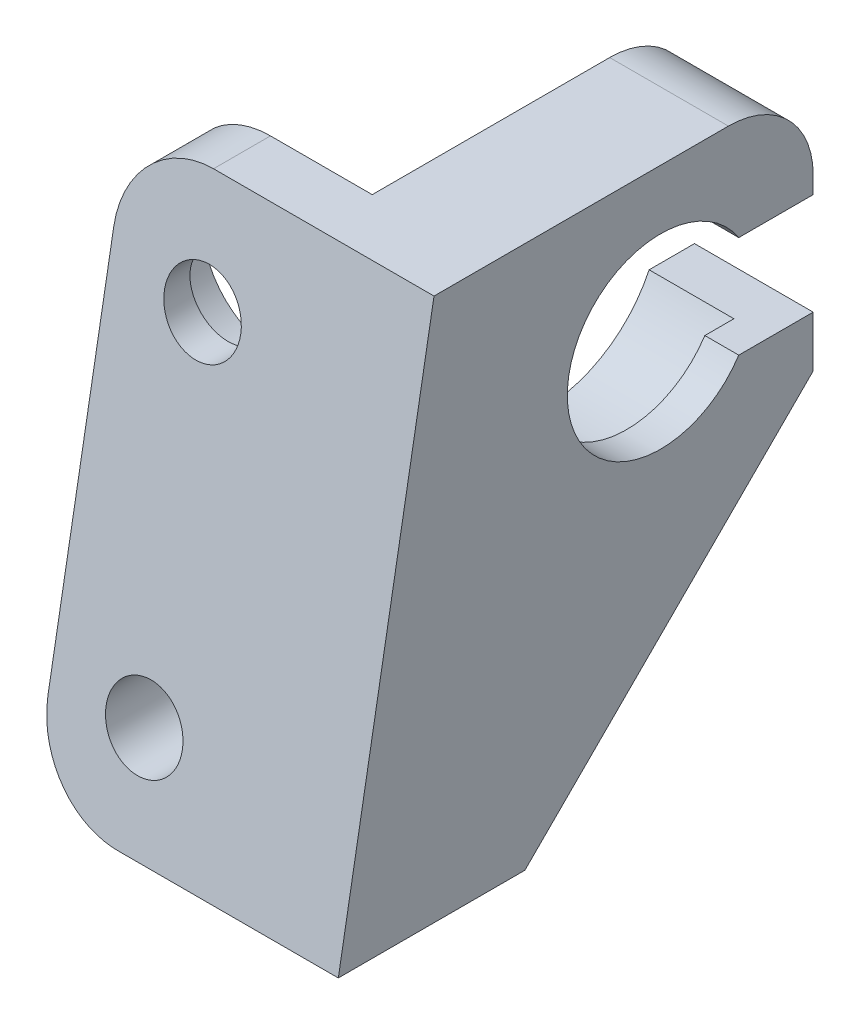
ISO-10303-21;
HEADER;
FILE_DESCRIPTION(('STEP AP214'),'2;1');
FILE_NAME('part.step','',(''),(''),'','','');
FILE_SCHEMA(('AUTOMOTIVE_DESIGN { 1 0 10303 214 1 1 1 1 }'));
ENDSEC;
DATA;
#1=APPLICATION_CONTEXT('core data for automotive mechanical design processes');
#2=APPLICATION_PROTOCOL_DEFINITION('international standard','automotive_design',2000,#1);
#3=PRODUCT_CONTEXT('',#1,'mechanical');
#4=PRODUCT('Part','Part','',(#3));
#5=PRODUCT_RELATED_PRODUCT_CATEGORY('part','',(#4));
#6=PRODUCT_DEFINITION_FORMATION('','',#4);
#7=PRODUCT_DEFINITION_CONTEXT('part definition',#1,'design');
#8=PRODUCT_DEFINITION('design','',#6,#7);
#9=PRODUCT_DEFINITION_SHAPE('','',#8);
#10=(LENGTH_UNIT() NAMED_UNIT(*) SI_UNIT(.MILLI.,.METRE.));
#11=(NAMED_UNIT(*) PLANE_ANGLE_UNIT() SI_UNIT($,.RADIAN.));
#12=(NAMED_UNIT(*) SI_UNIT($,.STERADIAN.) SOLID_ANGLE_UNIT());
#13=UNCERTAINTY_MEASURE_WITH_UNIT(LENGTH_MEASURE(1.E-05),#10,'distance_accuracy_value','');
#14=(GEOMETRIC_REPRESENTATION_CONTEXT(3) GLOBAL_UNCERTAINTY_ASSIGNED_CONTEXT((#13)) GLOBAL_UNIT_ASSIGNED_CONTEXT((#10,
#11,#12)) REPRESENTATION_CONTEXT('',''));
#15=CARTESIAN_POINT('',(0.,0.,0.));
#16=DIRECTION('',(0.,0.,1.));
#17=DIRECTION('',(1.,0.,0.));
#18=AXIS2_PLACEMENT_3D('',#15,#16,#17);
#19=CARTESIAN_POINT('',(-18.,32.,-28.));
#20=DIRECTION('',(0.,0.,1.));
#21=DIRECTION('',(0.,-1.,0.));
#22=AXIS2_PLACEMENT_3D('',#19,#20,#21);
#23=PLANE('',#22);
#24=DIRECTION('',(0.,1.,0.));
#25=VECTOR('',#24,1.);
#26=CARTESIAN_POINT('',(0.,32.,-28.));
#27=LINE('',#26,#25);
#28=CARTESIAN_POINT('',(0.,26.,-28.));
#29=VERTEX_POINT('',#28);
#30=CARTESIAN_POINT('',(0.,27.,-28.));
#31=VERTEX_POINT('',#30);
#32=EDGE_CURVE('E174',#29,#31,#27,.T.);
#33=ORIENTED_EDGE('',*,*,#32,.F.);
#34=DIRECTION('',(-1.,0.,0.));
#35=VECTOR('',#34,1.);
#36=CARTESIAN_POINT('',(0.,26.,-28.));
#37=LINE('',#36,#35);
#38=CARTESIAN_POINT('',(-7.,26.,-28.));
#39=VERTEX_POINT('',#38);
#40=EDGE_CURVE('E179',#29,#39,#37,.T.);
#41=ORIENTED_EDGE('',*,*,#40,.T.);
#42=DIRECTION('',(0.,1.,0.));
#43=VECTOR('',#42,1.);
#44=CARTESIAN_POINT('',(-7.,0.,-28.));
#45=LINE('',#44,#43);
#46=CARTESIAN_POINT('',(-7.,27.,-28.));
#47=VERTEX_POINT('',#46);
#48=EDGE_CURVE('E239',#39,#47,#45,.T.);
#49=ORIENTED_EDGE('',*,*,#48,.T.);
#50=DIRECTION('',(1.,0.,0.));
#51=VECTOR('',#50,1.);
#52=CARTESIAN_POINT('',(-18.,27.,-28.));
#53=LINE('',#52,#51);
#54=EDGE_CURVE('E278',#31,#47,#53,.F.);
#55=ORIENTED_EDGE('',*,*,#54,.F.);
#56=EDGE_LOOP('',(#33,#41,#49,#55));
#57=FACE_BOUND('',#56,.T.);
#58=ADVANCED_FACE('F35',(#57),#23,.F.);
#59=CARTESIAN_POINT('',(0.,23.,-19.));
#60=DIRECTION('',(-1.,0.,0.));
#61=DIRECTION('',(0.,0.,-1.));
#62=AXIS2_PLACEMENT_3D('',#59,#60,#61);
#63=CYLINDRICAL_SURFACE('',#62,5.5);
#64=CARTESIAN_POINT('',(0.,23.,-19.));
#65=DIRECTION('',(1.,0.,0.));
#66=DIRECTION('',(0.,0.,-1.));
#67=AXIS2_PLACEMENT_3D('',#64,#65,#66);
#68=CIRCLE('',#67,5.5);
#69=CARTESIAN_POINT('',(0.,26.,-23.6097722286464));
#70=VERTEX_POINT('',#69);
#71=CARTESIAN_POINT('',(0.,20.,-23.6097722286464));
#72=VERTEX_POINT('',#71);
#73=EDGE_CURVE('E202',#70,#72,#68,.T.);
#74=ORIENTED_EDGE('',*,*,#73,.T.);
#75=DIRECTION('',(-1.,0.,0.));
#76=VECTOR('',#75,1.);
#77=CARTESIAN_POINT('',(0.,20.,-23.6097722286464));
#78=LINE('',#77,#76);
#79=CARTESIAN_POINT('',(-2.,20.,-23.6097722286464));
#80=VERTEX_POINT('',#79);
#81=EDGE_CURVE('E157',#80,#72,#78,.F.);
#82=ORIENTED_EDGE('',*,*,#81,.F.);
#83=CARTESIAN_POINT('',(-2.,23.,-19.));
#84=DIRECTION('',(1.,0.,0.));
#85=DIRECTION('',(0.,0.,-1.));
#86=AXIS2_PLACEMENT_3D('',#83,#84,#85);
#87=CIRCLE('',#86,5.5);
#88=CARTESIAN_POINT('',(-2.,26.,-23.6097722286464));
#89=VERTEX_POINT('',#88);
#90=EDGE_CURVE('E199',#80,#89,#87,.F.);
#91=ORIENTED_EDGE('',*,*,#90,.T.);
#92=DIRECTION('',(-1.,0.,0.));
#93=VECTOR('',#92,1.);
#94=CARTESIAN_POINT('',(0.,26.,-23.6097722286464));
#95=LINE('',#94,#93);
#96=EDGE_CURVE('E192',#70,#89,#95,.T.);
#97=ORIENTED_EDGE('',*,*,#96,.F.);
#98=EDGE_LOOP('',(#74,#82,#91,#97));
#99=FACE_BOUND('',#98,.T.);
#100=ADVANCED_FACE('F325',(#99),#63,.F.);
#101=CARTESIAN_POINT('',(-18.,0.,-28.));
#102=DIRECTION('',(0.,1.,0.));
#103=DIRECTION('',(0.,0.,1.));
#104=AXIS2_PLACEMENT_3D('',#101,#102,#103);
#105=PLANE('',#104);
#106=DIRECTION('',(-1.,0.,0.));
#107=VECTOR('',#106,1.);
#108=CARTESIAN_POINT('',(-7.,0.,-9.));
#109=LINE('',#108,#107);
#110=CARTESIAN_POINT('',(-7.,0.,-9.));
#111=VERTEX_POINT('',#110);
#112=CARTESIAN_POINT('',(-13.,0.,-9.));
#113=VERTEX_POINT('',#112);
#114=EDGE_CURVE('E227',#111,#113,#109,.T.);
#115=ORIENTED_EDGE('',*,*,#114,.F.);
#116=DIRECTION('',(0.,0.,1.));
#117=VECTOR('',#116,1.);
#118=CARTESIAN_POINT('',(-7.,0.,-28.));
#119=LINE('',#118,#117);
#120=CARTESIAN_POINT('',(-7.,0.,-10.9999999999999));
#121=VERTEX_POINT('',#120);
#122=EDGE_CURVE('E224',#121,#111,#119,.T.);
#123=ORIENTED_EDGE('',*,*,#122,.F.);
#124=DIRECTION('',(-1.,0.,0.));
#125=VECTOR('',#124,1.);
#126=CARTESIAN_POINT('',(-18.,0.,-10.9999999999999));
#127=LINE('',#126,#125);
#128=CARTESIAN_POINT('',(0.,0.,-10.9999999999999));
#129=VERTEX_POINT('',#128);
#130=EDGE_CURVE('E268',#129,#121,#127,.T.);
#131=ORIENTED_EDGE('',*,*,#130,.F.);
#132=DIRECTION('',(0.,0.,-1.));
#133=VECTOR('',#132,1.);
#134=CARTESIAN_POINT('',(0.,0.,-28.));
#135=LINE('',#134,#133);
#136=CARTESIAN_POINT('',(0.,0.,0.));
#137=VERTEX_POINT('',#136);
#138=EDGE_CURVE('E238',#137,#129,#135,.T.);
#139=ORIENTED_EDGE('',*,*,#138,.F.);
#140=DIRECTION('',(1.,0.,0.));
#141=VECTOR('',#140,1.);
#142=CARTESIAN_POINT('',(-18.,0.,0.));
#143=LINE('',#142,#141);
#144=CARTESIAN_POINT('',(-13.,0.,0.));
#145=VERTEX_POINT('',#144);
#146=EDGE_CURVE('E246',#145,#137,#143,.T.);
#147=ORIENTED_EDGE('',*,*,#146,.F.);
#148=DIRECTION('',(0.,0.,-1.));
#149=VECTOR('',#148,1.);
#150=CARTESIAN_POINT('',(-13.,0.,0.));
#151=LINE('',#150,#149);
#152=EDGE_CURVE('E292',#113,#145,#151,.F.);
#153=ORIENTED_EDGE('',*,*,#152,.F.);
#154=EDGE_LOOP('',(#115,#123,#131,#139,#147,#153));
#155=FACE_BOUND('',#154,.T.);
#156=ADVANCED_FACE('F310',(#155),#105,.F.);
#157=CARTESIAN_POINT('',(-7.,17.,-28.));
#158=VERTEX_POINT('',#157);
#159=CARTESIAN_POINT('',(-7.,20.,-28.));
#160=VERTEX_POINT('',#159);
#161=EDGE_CURVE('E178',#158,#160,#45,.T.);
#162=ORIENTED_EDGE('',*,*,#161,.T.);
#163=DIRECTION('',(-1.,0.,0.));
#164=VECTOR('',#163,1.);
#165=CARTESIAN_POINT('',(0.,20.,-28.));
#166=LINE('',#165,#164);
#167=CARTESIAN_POINT('',(0.,20.,-28.));
#168=VERTEX_POINT('',#167);
#169=EDGE_CURVE('E154',#168,#160,#166,.T.);
#170=ORIENTED_EDGE('',*,*,#169,.F.);
#171=CARTESIAN_POINT('',(0.,17.,-28.));
#172=VERTEX_POINT('',#171);
#173=EDGE_CURVE('E165',#172,#168,#27,.T.);
#174=ORIENTED_EDGE('',*,*,#173,.F.);
#175=DIRECTION('',(1.,0.,0.));
#176=VECTOR('',#175,1.);
#177=CARTESIAN_POINT('',(-18.,17.,-28.));
#178=LINE('',#177,#176);
#179=EDGE_CURVE('E265',#158,#172,#178,.T.);
#180=ORIENTED_EDGE('',*,*,#179,.F.);
#181=EDGE_LOOP('',(#162,#170,#174,#180));
#182=FACE_BOUND('',#181,.T.);
#183=ADVANCED_FACE('F176',(#182),#23,.F.);
#184=CARTESIAN_POINT('',(-18.,32.,-5.64246338267089));
#185=DIRECTION('',(0.,-1.,0.));
#186=DIRECTION('',(0.,0.,-1.));
#187=AXIS2_PLACEMENT_3D('',#184,#185,#186);
#188=PLANE('',#187);
#189=DIRECTION('',(1.,0.,0.));
#190=VECTOR('',#189,1.);
#191=CARTESIAN_POINT('',(-18.,32.,-5.64246338267089));
#192=LINE('',#191,#190);
#193=CARTESIAN_POINT('',(-13.,32.,-5.64246338267089));
#194=VERTEX_POINT('',#193);
#195=CARTESIAN_POINT('',(0.,32.,-5.64246338267089));
#196=VERTEX_POINT('',#195);
#197=EDGE_CURVE('E252',#194,#196,#192,.T.);
#198=ORIENTED_EDGE('',*,*,#197,.T.);
#199=DIRECTION('',(0.,0.,1.));
#200=VECTOR('',#199,1.);
#201=CARTESIAN_POINT('',(0.,32.,-5.64246338267089));
#202=LINE('',#201,#200);
#203=CARTESIAN_POINT('',(0.,32.,-23.));
#204=VERTEX_POINT('',#203);
#205=EDGE_CURVE('E173',#204,#196,#202,.T.);
#206=ORIENTED_EDGE('',*,*,#205,.F.);
#207=DIRECTION('',(1.,0.,0.));
#208=VECTOR('',#207,1.);
#209=CARTESIAN_POINT('',(-18.,32.,-23.));
#210=LINE('',#209,#208);
#211=CARTESIAN_POINT('',(-7.,32.,-23.));
#212=VERTEX_POINT('',#211);
#213=EDGE_CURVE('E273',#212,#204,#210,.T.);
#214=ORIENTED_EDGE('',*,*,#213,.F.);
#215=DIRECTION('',(0.,0.,1.));
#216=VECTOR('',#215,1.);
#217=CARTESIAN_POINT('',(-7.,32.,-28.));
#218=LINE('',#217,#216);
#219=CARTESIAN_POINT('',(-7.,32.,-9.));
#220=VERTEX_POINT('',#219);
#221=EDGE_CURVE('E232',#212,#220,#218,.T.);
#222=ORIENTED_EDGE('',*,*,#221,.T.);
#223=DIRECTION('',(-1.,0.,0.));
#224=VECTOR('',#223,1.);
#225=CARTESIAN_POINT('',(-7.,32.,-9.));
#226=LINE('',#225,#224);
#227=CARTESIAN_POINT('',(-13.,32.,-9.));
#228=VERTEX_POINT('',#227);
#229=EDGE_CURVE('E228',#220,#228,#226,.T.);
#230=ORIENTED_EDGE('',*,*,#229,.T.);
#231=DIRECTION('',(0.,0.,1.));
#232=VECTOR('',#231,1.);
#233=CARTESIAN_POINT('',(-13.,32.,-9.));
#234=LINE('',#233,#232);
#235=EDGE_CURVE('E11',#194,#228,#234,.F.);
#236=ORIENTED_EDGE('',*,*,#235,.F.);
#237=EDGE_LOOP('',(#198,#206,#214,#222,#230,#236));
#238=FACE_BOUND('',#237,.T.);
#239=ADVANCED_FACE('F318',(#238),#188,.F.);
#240=CARTESIAN_POINT('',(-18.,0.,0.));
#241=DIRECTION('',(0.,-0.173648177666931,-0.984807753012208));
#242=DIRECTION('',(0.,0.984807753012208,-0.173648177666931));
#243=AXIS2_PLACEMENT_3D('',#240,#241,#242);
#244=PLANE('',#243);
#245=CARTESIAN_POINT('',(-12.5,25.5,-4.49633800806587));
#246=DIRECTION('',(0.,0.173648177666931,0.984807753012208));
#247=DIRECTION('',(0.,0.984807753012208,-0.173648177666931));
#248=AXIS2_PLACEMENT_3D('',#245,#246,#247);
#249=ELLIPSE('',#248,2.28470987674293,2.25);
#250=CARTESIAN_POINT('',(-12.5,27.75,-4.89307371465991));
#251=VERTEX_POINT('',#250);
#252=EDGE_CURVE('E213',#251,#251,#249,.T.);
#253=ORIENTED_EDGE('',*,*,#252,.F.);
#254=EDGE_LOOP('',(#253));
#255=FACE_BOUND('',#254,.T.);
#256=CARTESIAN_POINT('',(-12.5,6.,-1.05796188425079));
#257=DIRECTION('',(0.,0.173648177666931,0.984807753012208));
#258=DIRECTION('',(0.,0.984807753012208,-0.173648177666931));
#259=AXIS2_PLACEMENT_3D('',#256,#257,#258);
#260=ELLIPSE('',#259,2.28470987674292,2.25);
#261=CARTESIAN_POINT('',(-12.5,8.25,-1.45469759084484));
#262=VERTEX_POINT('',#261);
#263=EDGE_CURVE('E223',#262,#262,#260,.T.);
#264=ORIENTED_EDGE('',*,*,#263,.F.);
#265=EDGE_LOOP('',(#264));
#266=FACE_BOUND('',#265,.T.);
#267=ORIENTED_EDGE('',*,*,#146,.T.);
#268=DIRECTION('',(0.,-0.984807753012208,0.173648177666931));
#269=VECTOR('',#268,1.);
#270=CARTESIAN_POINT('',(0.,0.,0.));
#271=LINE('',#270,#269);
#272=EDGE_CURVE('E247',#196,#137,#271,.T.);
#273=ORIENTED_EDGE('',*,*,#272,.F.);
#274=ORIENTED_EDGE('',*,*,#197,.F.);
#275=CARTESIAN_POINT('',(-13.,27.,-4.76082847912857));
#276=DIRECTION('',(0.,0.173648177666931,0.984807753012208));
#277=DIRECTION('',(0.,0.984807753012208,-0.173648177666931));
#278=AXIS2_PLACEMENT_3D('',#275,#276,#277);
#279=ELLIPSE('',#278,5.07713305942872,5.);
#280=CARTESIAN_POINT('',(-18.,27.,-4.76082847912857));
#281=VERTEX_POINT('',#280);
#282=EDGE_CURVE('E49',#281,#194,#279,.F.);
#283=ORIENTED_EDGE('',*,*,#282,.F.);
#284=DIRECTION('',(0.,-0.984807753012208,0.173648177666931));
#285=VECTOR('',#284,1.);
#286=CARTESIAN_POINT('',(-18.,0.,0.));
#287=LINE('',#286,#285);
#288=CARTESIAN_POINT('',(-18.,5.,-0.881634903542327));
#289=VERTEX_POINT('',#288);
#290=EDGE_CURVE('E244',#281,#289,#287,.T.);
#291=ORIENTED_EDGE('',*,*,#290,.T.);
#292=CARTESIAN_POINT('',(-13.,5.,-0.881634903542327));
#293=DIRECTION('',(0.,0.173648177666931,0.984807753012208));
#294=DIRECTION('',(0.,-0.984807753012208,0.173648177666931));
#295=AXIS2_PLACEMENT_3D('',#292,#293,#294);
#296=ELLIPSE('',#295,5.07713305942872,5.);
#297=EDGE_CURVE('E43',#145,#289,#296,.F.);
#298=ORIENTED_EDGE('',*,*,#297,.F.);
#299=EDGE_LOOP('',(#267,#273,#274,#283,#291,#298));
#300=FACE_BOUND('',#299,.T.);
#301=ADVANCED_FACE('F300',(#255,#266,#300),#244,.F.);
#302=CARTESIAN_POINT('',(-18.,0.,0.));
#303=DIRECTION('',(-1.,0.,0.));
#304=DIRECTION('',(0.,0.,-1.));
#305=AXIS2_PLACEMENT_3D('',#302,#303,#304);
#306=PLANE('',#305);
#307=ORIENTED_EDGE('',*,*,#290,.F.);
#308=DIRECTION('',(0.,0.,1.));
#309=VECTOR('',#308,1.);
#310=CARTESIAN_POINT('',(-18.,27.,-5.64246338267089));
#311=LINE('',#310,#309);
#312=CARTESIAN_POINT('',(-18.,27.,-9.));
#313=VERTEX_POINT('',#312);
#314=EDGE_CURVE('E283',#313,#281,#311,.T.);
#315=ORIENTED_EDGE('',*,*,#314,.F.);
#316=DIRECTION('',(0.,1.,0.));
#317=VECTOR('',#316,1.);
#318=CARTESIAN_POINT('',(-18.,0.,-9.));
#319=LINE('',#318,#317);
#320=CARTESIAN_POINT('',(-18.,5.,-9.));
#321=VERTEX_POINT('',#320);
#322=EDGE_CURVE('E240',#321,#313,#319,.T.);
#323=ORIENTED_EDGE('',*,*,#322,.F.);
#324=DIRECTION('',(0.,0.,-1.));
#325=VECTOR('',#324,1.);
#326=CARTESIAN_POINT('',(-18.,5.,-9.));
#327=LINE('',#326,#325);
#328=EDGE_CURVE('E285',#289,#321,#327,.T.);
#329=ORIENTED_EDGE('',*,*,#328,.F.);
#330=EDGE_LOOP('',(#307,#315,#323,#329));
#331=FACE_BOUND('',#330,.T.);
#332=ADVANCED_FACE('F304',(#331),#306,.T.);
#333=CARTESIAN_POINT('',(0.,0.,0.));
#334=DIRECTION('',(-1.,0.,0.));
#335=DIRECTION('',(0.,0.,-1.));
#336=AXIS2_PLACEMENT_3D('',#333,#334,#335);
#337=PLANE('',#336);
#338=ORIENTED_EDGE('',*,*,#205,.T.);
#339=ORIENTED_EDGE('',*,*,#272,.T.);
#340=ORIENTED_EDGE('',*,*,#138,.T.);
#341=DIRECTION('',(0.,0.707106781186546,-0.707106781186549));
#342=VECTOR('',#341,1.);
#343=CARTESIAN_POINT('',(0.,17.,-28.));
#344=LINE('',#343,#342);
#345=EDGE_CURVE('E169',#172,#129,#344,.F.);
#346=ORIENTED_EDGE('',*,*,#345,.F.);
#347=ORIENTED_EDGE('',*,*,#173,.T.);
#348=DIRECTION('',(0.,0.,-1.));
#349=VECTOR('',#348,1.);
#350=CARTESIAN_POINT('',(0.,20.,-19.));
#351=LINE('',#350,#349);
#352=EDGE_CURVE('E149',#72,#168,#351,.T.);
#353=ORIENTED_EDGE('',*,*,#352,.F.);
#354=ORIENTED_EDGE('',*,*,#73,.F.);
#355=DIRECTION('',(0.,0.,1.));
#356=VECTOR('',#355,1.);
#357=CARTESIAN_POINT('',(0.,26.,-19.));
#358=LINE('',#357,#356);
#359=EDGE_CURVE('E161',#29,#70,#358,.T.);
#360=ORIENTED_EDGE('',*,*,#359,.F.);
#361=ORIENTED_EDGE('',*,*,#32,.T.);
#362=CARTESIAN_POINT('',(0.,27.,-23.));
#363=DIRECTION('',(1.,0.,0.));
#364=DIRECTION('',(0.,0.,-1.));
#365=AXIS2_PLACEMENT_3D('',#362,#363,#364);
#366=CIRCLE('',#365,5.);
#367=EDGE_CURVE('E276',#204,#31,#366,.F.);
#368=ORIENTED_EDGE('',*,*,#367,.F.);
#369=EDGE_LOOP('',(#338,#339,#340,#346,#347,#353,#354,#360,#361,#368));
#370=FACE_BOUND('',#369,.T.);
#371=ADVANCED_FACE('F167',(#370),#337,.F.);
#372=CARTESIAN_POINT('',(-7.,0.,-28.));
#373=DIRECTION('',(1.,0.,0.));
#374=DIRECTION('',(0.,0.,1.));
#375=AXIS2_PLACEMENT_3D('',#372,#373,#374);
#376=PLANE('',#375);
#377=ORIENTED_EDGE('',*,*,#48,.F.);
#378=DIRECTION('',(0.,0.,1.));
#379=VECTOR('',#378,1.);
#380=CARTESIAN_POINT('',(-7.,26.,-19.));
#381=LINE('',#380,#379);
#382=CARTESIAN_POINT('',(-7.,26.,-25.3245553203368));
#383=VERTEX_POINT('',#382);
#384=EDGE_CURVE('E162',#39,#383,#381,.T.);
#385=ORIENTED_EDGE('',*,*,#384,.T.);
#386=CARTESIAN_POINT('',(-7.,23.,-19.));
#387=DIRECTION('',(1.,0.,0.));
#388=DIRECTION('',(0.,0.,-1.));
#389=AXIS2_PLACEMENT_3D('',#386,#387,#388);
#390=CIRCLE('',#389,7.);
#391=CARTESIAN_POINT('',(-7.,20.,-25.3245553203368));
#392=VERTEX_POINT('',#391);
#393=EDGE_CURVE('E195',#383,#392,#390,.T.);
#394=ORIENTED_EDGE('',*,*,#393,.T.);
#395=DIRECTION('',(0.,0.,-1.));
#396=VECTOR('',#395,1.);
#397=CARTESIAN_POINT('',(-7.,20.,-19.));
#398=LINE('',#397,#396);
#399=EDGE_CURVE('E359',#392,#160,#398,.T.);
#400=ORIENTED_EDGE('',*,*,#399,.T.);
#401=ORIENTED_EDGE('',*,*,#161,.F.);
#402=DIRECTION('',(0.,-0.707106781186546,0.707106781186549));
#403=VECTOR('',#402,1.);
#404=CARTESIAN_POINT('',(-7.,17.,-28.));
#405=LINE('',#404,#403);
#406=EDGE_CURVE('E271',#121,#158,#405,.F.);
#407=ORIENTED_EDGE('',*,*,#406,.F.);
#408=ORIENTED_EDGE('',*,*,#122,.T.);
#409=DIRECTION('',(0.,1.,0.));
#410=VECTOR('',#409,1.);
#411=CARTESIAN_POINT('',(-7.,0.,-9.));
#412=LINE('',#411,#410);
#413=EDGE_CURVE('E231',#111,#220,#412,.T.);
#414=ORIENTED_EDGE('',*,*,#413,.T.);
#415=ORIENTED_EDGE('',*,*,#221,.F.);
#416=CARTESIAN_POINT('',(-7.,27.,-23.));
#417=DIRECTION('',(-1.,0.,0.));
#418=DIRECTION('',(0.,0.,1.));
#419=AXIS2_PLACEMENT_3D('',#416,#417,#418);
#420=CIRCLE('',#419,5.);
#421=EDGE_CURVE('E281',#47,#212,#420,.F.);
#422=ORIENTED_EDGE('',*,*,#421,.F.);
#423=EDGE_LOOP('',(#377,#385,#394,#400,#401,#407,#408,#414,#415,#422));
#424=FACE_BOUND('',#423,.T.);
#425=ADVANCED_FACE('F358',(#424),#376,.F.);
#426=CARTESIAN_POINT('',(-7.,0.,-9.));
#427=DIRECTION('',(0.,0.,1.));
#428=DIRECTION('',(-1.,0.,0.));
#429=AXIS2_PLACEMENT_3D('',#426,#427,#428);
#430=PLANE('',#429);
#431=CARTESIAN_POINT('',(-12.5,25.5,-9.));
#432=DIRECTION('',(0.,0.,1.));
#433=DIRECTION('',(1.,0.,0.));
#434=AXIS2_PLACEMENT_3D('',#431,#432,#433);
#435=CIRCLE('',#434,4.5);
#436=CARTESIAN_POINT('',(-8.,25.5,-9.));
#437=VERTEX_POINT('',#436);
#438=EDGE_CURVE('E204',#437,#437,#435,.T.);
#439=ORIENTED_EDGE('',*,*,#438,.T.);
#440=EDGE_LOOP('',(#439));
#441=FACE_BOUND('',#440,.T.);
#442=CARTESIAN_POINT('',(-12.5,6.,-9.));
#443=DIRECTION('',(0.,0.,1.));
#444=DIRECTION('',(1.,0.,0.));
#445=AXIS2_PLACEMENT_3D('',#442,#443,#444);
#446=CIRCLE('',#445,3.99999999999999);
#447=CARTESIAN_POINT('',(-8.50000000000001,6.,-9.));
#448=VERTEX_POINT('',#447);
#449=EDGE_CURVE('E214',#448,#448,#446,.T.);
#450=ORIENTED_EDGE('',*,*,#449,.T.);
#451=EDGE_LOOP('',(#450));
#452=FACE_BOUND('',#451,.T.);
#453=ORIENTED_EDGE('',*,*,#322,.T.);
#454=CARTESIAN_POINT('',(-13.,27.,-9.));
#455=DIRECTION('',(0.,0.,-1.));
#456=DIRECTION('',(-1.,0.,0.));
#457=AXIS2_PLACEMENT_3D('',#454,#455,#456);
#458=CIRCLE('',#457,5.);
#459=EDGE_CURVE('E288',#228,#313,#458,.F.);
#460=ORIENTED_EDGE('',*,*,#459,.F.);
#461=ORIENTED_EDGE('',*,*,#229,.F.);
#462=ORIENTED_EDGE('',*,*,#413,.F.);
#463=ORIENTED_EDGE('',*,*,#114,.T.);
#464=CARTESIAN_POINT('',(-13.,5.,-9.));
#465=DIRECTION('',(0.,0.,-1.));
#466=DIRECTION('',(-1.,0.,0.));
#467=AXIS2_PLACEMENT_3D('',#464,#465,#466);
#468=CIRCLE('',#467,5.);
#469=EDGE_CURVE('E290',#321,#113,#468,.F.);
#470=ORIENTED_EDGE('',*,*,#469,.F.);
#471=EDGE_LOOP('',(#453,#460,#461,#462,#463,#470));
#472=FACE_BOUND('',#471,.T.);
#473=ADVANCED_FACE('F306',(#441,#452,#472),#430,.F.);
#474=CARTESIAN_POINT('',(-12.5,6.,-9.));
#475=DIRECTION('',(0.,0.,-1.));
#476=DIRECTION('',(1.,0.,0.));
#477=AXIS2_PLACEMENT_3D('',#474,#475,#476);
#478=CYLINDRICAL_SURFACE('',#477,2.25);
#479=CARTESIAN_POINT('',(-12.5,6.,-4.6));
#480=DIRECTION('',(0.,0.,1.));
#481=DIRECTION('',(1.,0.,0.));
#482=AXIS2_PLACEMENT_3D('',#479,#480,#481);
#483=CIRCLE('',#482,2.25);
#484=CARTESIAN_POINT('',(-10.25,6.,-4.6));
#485=VERTEX_POINT('',#484);
#486=EDGE_CURVE('E220',#485,#485,#483,.T.);
#487=ORIENTED_EDGE('',*,*,#486,.F.);
#488=EDGE_LOOP('',(#487));
#489=FACE_BOUND('',#488,.T.);
#490=ORIENTED_EDGE('',*,*,#263,.T.);
#491=EDGE_LOOP('',(#490));
#492=FACE_BOUND('',#491,.T.);
#493=ADVANCED_FACE('F401',(#489,#492),#478,.F.);
#494=CARTESIAN_POINT('',(-14.75,6.,-4.6));
#495=DIRECTION('',(0.,0.,1.));
#496=DIRECTION('',(-1.,0.,0.));
#497=AXIS2_PLACEMENT_3D('',#494,#495,#496);
#498=PLANE('',#497);
#499=ORIENTED_EDGE('',*,*,#486,.T.);
#500=EDGE_LOOP('',(#499));
#501=FACE_BOUND('',#500,.T.);
#502=CARTESIAN_POINT('',(-12.5,6.,-4.6));
#503=DIRECTION('',(0.,0.,1.));
#504=DIRECTION('',(1.,0.,0.));
#505=AXIS2_PLACEMENT_3D('',#502,#503,#504);
#506=CIRCLE('',#505,4.);
#507=CARTESIAN_POINT('',(-8.5,6.,-4.6));
#508=VERTEX_POINT('',#507);
#509=EDGE_CURVE('E217',#508,#508,#506,.T.);
#510=ORIENTED_EDGE('',*,*,#509,.F.);
#511=EDGE_LOOP('',(#510));
#512=FACE_BOUND('',#511,.T.);
#513=ADVANCED_FACE('F397',(#501,#512),#498,.F.);
#514=CARTESIAN_POINT('',(-12.5,6.,-9.));
#515=DIRECTION('',(0.,0.,-1.));
#516=DIRECTION('',(1.,0.,0.));
#517=AXIS2_PLACEMENT_3D('',#514,#515,#516);
#518=CYLINDRICAL_SURFACE('',#517,3.99999999999999);
#519=ORIENTED_EDGE('',*,*,#509,.T.);
#520=EDGE_LOOP('',(#519));
#521=FACE_BOUND('',#520,.T.);
#522=ORIENTED_EDGE('',*,*,#449,.F.);
#523=EDGE_LOOP('',(#522));
#524=FACE_BOUND('',#523,.T.);
#525=ADVANCED_FACE('F393',(#521,#524),#518,.F.);
#526=CARTESIAN_POINT('',(-12.5,25.5,-9.));
#527=DIRECTION('',(0.,0.,-1.));
#528=DIRECTION('',(1.,0.,0.));
#529=AXIS2_PLACEMENT_3D('',#526,#527,#528);
#530=CYLINDRICAL_SURFACE('',#529,2.25);
#531=CARTESIAN_POINT('',(-12.5,25.5,-6.));
#532=DIRECTION('',(0.,0.,1.));
#533=DIRECTION('',(1.,0.,0.));
#534=AXIS2_PLACEMENT_3D('',#531,#532,#533);
#535=CIRCLE('',#534,2.25);
#536=CARTESIAN_POINT('',(-10.25,25.5,-6.));
#537=VERTEX_POINT('',#536);
#538=EDGE_CURVE('E210',#537,#537,#535,.T.);
#539=ORIENTED_EDGE('',*,*,#538,.F.);
#540=EDGE_LOOP('',(#539));
#541=FACE_BOUND('',#540,.T.);
#542=ORIENTED_EDGE('',*,*,#252,.T.);
#543=EDGE_LOOP('',(#542));
#544=FACE_BOUND('',#543,.T.);
#545=ADVANCED_FACE('F389',(#541,#544),#530,.F.);
#546=CARTESIAN_POINT('',(-14.75,25.5,-6.));
#547=DIRECTION('',(0.,0.,1.));
#548=DIRECTION('',(-1.,0.,0.));
#549=AXIS2_PLACEMENT_3D('',#546,#547,#548);
#550=PLANE('',#549);
#551=ORIENTED_EDGE('',*,*,#538,.T.);
#552=EDGE_LOOP('',(#551));
#553=FACE_BOUND('',#552,.T.);
#554=CARTESIAN_POINT('',(-12.5,25.5,-6.));
#555=DIRECTION('',(0.,0.,1.));
#556=DIRECTION('',(1.,0.,0.));
#557=AXIS2_PLACEMENT_3D('',#554,#555,#556);
#558=CIRCLE('',#557,4.5);
#559=CARTESIAN_POINT('',(-8.,25.5,-6.));
#560=VERTEX_POINT('',#559);
#561=EDGE_CURVE('E207',#560,#560,#558,.T.);
#562=ORIENTED_EDGE('',*,*,#561,.F.);
#563=EDGE_LOOP('',(#562));
#564=FACE_BOUND('',#563,.T.);
#565=ADVANCED_FACE('F381',(#553,#564),#550,.F.);
#566=CARTESIAN_POINT('',(-12.5,25.5,-9.));
#567=DIRECTION('',(0.,0.,-1.));
#568=DIRECTION('',(1.,0.,0.));
#569=AXIS2_PLACEMENT_3D('',#566,#567,#568);
#570=CYLINDRICAL_SURFACE('',#569,4.5);
#571=ORIENTED_EDGE('',*,*,#561,.T.);
#572=EDGE_LOOP('',(#571));
#573=FACE_BOUND('',#572,.T.);
#574=ORIENTED_EDGE('',*,*,#438,.F.);
#575=EDGE_LOOP('',(#574));
#576=FACE_BOUND('',#575,.T.);
#577=ADVANCED_FACE('F374',(#573,#576),#570,.F.);
#578=CARTESIAN_POINT('',(-2.,23.,-19.));
#579=DIRECTION('',(-1.,0.,0.));
#580=DIRECTION('',(0.,0.,-1.));
#581=AXIS2_PLACEMENT_3D('',#578,#579,#580);
#582=PLANE('',#581);
#583=DIRECTION('',(0.,0.,1.));
#584=VECTOR('',#583,1.);
#585=CARTESIAN_POINT('',(-2.,26.,-19.));
#586=LINE('',#585,#584);
#587=CARTESIAN_POINT('',(-2.,26.,-25.3245553203368));
#588=VERTEX_POINT('',#587);
#589=EDGE_CURVE('E190',#588,#89,#586,.T.);
#590=ORIENTED_EDGE('',*,*,#589,.T.);
#591=ORIENTED_EDGE('',*,*,#90,.F.);
#592=DIRECTION('',(0.,0.,-1.));
#593=VECTOR('',#592,1.);
#594=CARTESIAN_POINT('',(-2.,20.,-19.));
#595=LINE('',#594,#593);
#596=CARTESIAN_POINT('',(-2.,20.,-25.3245553203368));
#597=VERTEX_POINT('',#596);
#598=EDGE_CURVE('E182',#80,#597,#595,.T.);
#599=ORIENTED_EDGE('',*,*,#598,.T.);
#600=CARTESIAN_POINT('',(-2.,23.,-19.));
#601=DIRECTION('',(1.,0.,0.));
#602=DIRECTION('',(0.,0.,-1.));
#603=AXIS2_PLACEMENT_3D('',#600,#601,#602);
#604=CIRCLE('',#603,7.);
#605=EDGE_CURVE('E196',#588,#597,#604,.T.);
#606=ORIENTED_EDGE('',*,*,#605,.F.);
#607=EDGE_LOOP('',(#590,#591,#599,#606));
#608=FACE_BOUND('',#607,.T.);
#609=ADVANCED_FACE('F371',(#608),#582,.T.);
#610=CARTESIAN_POINT('',(-2.,23.,-19.));
#611=DIRECTION('',(-1.,0.,0.));
#612=DIRECTION('',(0.,0.,-1.));
#613=AXIS2_PLACEMENT_3D('',#610,#611,#612);
#614=CYLINDRICAL_SURFACE('',#613,7.);
#615=ORIENTED_EDGE('',*,*,#605,.T.);
#616=DIRECTION('',(-1.,0.,0.));
#617=VECTOR('',#616,1.);
#618=CARTESIAN_POINT('',(-2.,20.,-25.3245553203368));
#619=LINE('',#618,#617);
#620=EDGE_CURVE('E255',#392,#597,#619,.F.);
#621=ORIENTED_EDGE('',*,*,#620,.F.);
#622=ORIENTED_EDGE('',*,*,#393,.F.);
#623=DIRECTION('',(-1.,0.,0.));
#624=VECTOR('',#623,1.);
#625=CARTESIAN_POINT('',(-2.,26.,-25.3245553203368));
#626=LINE('',#625,#624);
#627=EDGE_CURVE('E263',#588,#383,#626,.T.);
#628=ORIENTED_EDGE('',*,*,#627,.F.);
#629=EDGE_LOOP('',(#615,#621,#622,#628));
#630=FACE_BOUND('',#629,.T.);
#631=ADVANCED_FACE('F368',(#630),#614,.F.);
#632=CARTESIAN_POINT('',(0.,20.,-19.));
#633=DIRECTION('',(0.,-1.,0.));
#634=DIRECTION('',(0.,0.,-1.));
#635=AXIS2_PLACEMENT_3D('',#632,#633,#634);
#636=PLANE('',#635);
#637=ORIENTED_EDGE('',*,*,#598,.F.);
#638=ORIENTED_EDGE('',*,*,#81,.T.);
#639=ORIENTED_EDGE('',*,*,#352,.T.);
#640=ORIENTED_EDGE('',*,*,#169,.T.);
#641=ORIENTED_EDGE('',*,*,#399,.F.);
#642=ORIENTED_EDGE('',*,*,#620,.T.);
#643=EDGE_LOOP('',(#637,#638,#639,#640,#641,#642));
#644=FACE_BOUND('',#643,.T.);
#645=ADVANCED_FACE('F151',(#644),#636,.F.);
#646=CARTESIAN_POINT('',(0.,26.,-19.));
#647=DIRECTION('',(0.,1.,0.));
#648=DIRECTION('',(0.,0.,1.));
#649=AXIS2_PLACEMENT_3D('',#646,#647,#648);
#650=PLANE('',#649);
#651=ORIENTED_EDGE('',*,*,#359,.T.);
#652=ORIENTED_EDGE('',*,*,#96,.T.);
#653=ORIENTED_EDGE('',*,*,#589,.F.);
#654=ORIENTED_EDGE('',*,*,#627,.T.);
#655=ORIENTED_EDGE('',*,*,#384,.F.);
#656=ORIENTED_EDGE('',*,*,#40,.F.);
#657=EDGE_LOOP('',(#651,#652,#653,#654,#655,#656));
#658=FACE_BOUND('',#657,.T.);
#659=ADVANCED_FACE('F347',(#658),#650,.F.);
#660=CARTESIAN_POINT('',(-18.,17.,-28.));
#661=DIRECTION('',(0.,0.707106781186549,0.707106781186546));
#662=DIRECTION('',(1.,0.,0.));
#663=AXIS2_PLACEMENT_3D('',#660,#661,#662);
#664=PLANE('',#663);
#665=ORIENTED_EDGE('',*,*,#406,.T.);
#666=ORIENTED_EDGE('',*,*,#179,.T.);
#667=ORIENTED_EDGE('',*,*,#345,.T.);
#668=ORIENTED_EDGE('',*,*,#130,.T.);
#669=EDGE_LOOP('',(#665,#666,#667,#668));
#670=FACE_BOUND('',#669,.T.);
#671=ADVANCED_FACE('F344',(#670),#664,.F.);
#672=CARTESIAN_POINT('',(-18.,27.,-23.));
#673=DIRECTION('',(1.,0.,0.));
#674=DIRECTION('',(0.,0.,1.));
#675=AXIS2_PLACEMENT_3D('',#672,#673,#674);
#676=CYLINDRICAL_SURFACE('',#675,5.);
#677=ORIENTED_EDGE('',*,*,#421,.T.);
#678=ORIENTED_EDGE('',*,*,#213,.T.);
#679=ORIENTED_EDGE('',*,*,#367,.T.);
#680=ORIENTED_EDGE('',*,*,#54,.T.);
#681=EDGE_LOOP('',(#677,#678,#679,#680));
#682=FACE_BOUND('',#681,.T.);
#683=ADVANCED_FACE('F323',(#682),#676,.T.);
#684=CARTESIAN_POINT('',(-13.,5.,0.));
#685=DIRECTION('',(0.,0.,1.));
#686=DIRECTION('',(0.,-1.,0.));
#687=AXIS2_PLACEMENT_3D('',#684,#685,#686);
#688=CYLINDRICAL_SURFACE('',#687,5.);
#689=ORIENTED_EDGE('',*,*,#297,.T.);
#690=ORIENTED_EDGE('',*,*,#328,.T.);
#691=ORIENTED_EDGE('',*,*,#469,.T.);
#692=ORIENTED_EDGE('',*,*,#152,.T.);
#693=EDGE_LOOP('',(#689,#690,#691,#692));
#694=FACE_BOUND('',#693,.T.);
#695=ADVANCED_FACE('F295',(#694),#688,.T.);
#696=CARTESIAN_POINT('',(-13.,27.,0.));
#697=DIRECTION('',(0.,0.,-1.));
#698=DIRECTION('',(1.,0.,0.));
#699=AXIS2_PLACEMENT_3D('',#696,#697,#698);
#700=CYLINDRICAL_SURFACE('',#699,5.);
#701=ORIENTED_EDGE('',*,*,#459,.T.);
#702=ORIENTED_EDGE('',*,*,#314,.T.);
#703=ORIENTED_EDGE('',*,*,#282,.T.);
#704=ORIENTED_EDGE('',*,*,#235,.T.);
#705=EDGE_LOOP('',(#701,#702,#703,#704));
#706=FACE_BOUND('',#705,.T.);
#707=ADVANCED_FACE('F37',(#706),#700,.T.);
#708=CLOSED_SHELL('',(#58,#100,#156,#183,#239,#301,#332,#371,#425,#473,#493,#513,#525,#545,#565,
#577,#609,#631,#645,#659,#671,#683,#695,#707));
#709=MANIFOLD_SOLID_BREP('B2',#708);
#710=ADVANCED_BREP_SHAPE_REPRESENTATION('',(#18,#709),#14);
#711=SHAPE_DEFINITION_REPRESENTATION(#9,#710);
ENDSEC;
END-ISO-10303-21;
